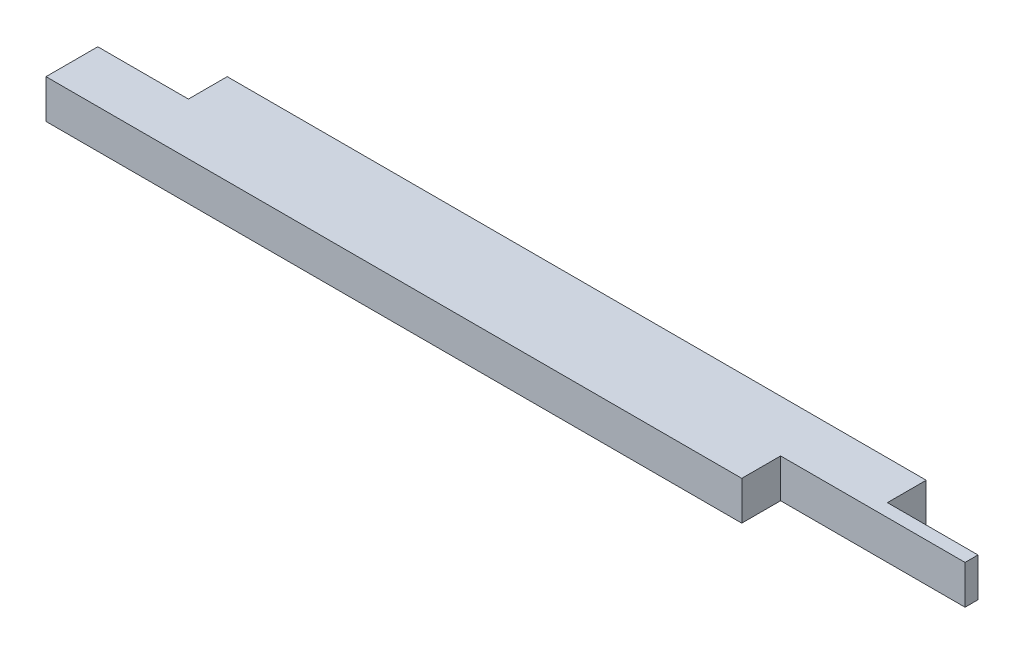
ISO-10303-21;
HEADER;
FILE_DESCRIPTION(('STEP AP214'),'2;1');
FILE_NAME('part.step','',(''),(''),'','','');
FILE_SCHEMA(('AUTOMOTIVE_DESIGN { 1 0 10303 214 1 1 1 1 }'));
ENDSEC;
DATA;
#1=APPLICATION_CONTEXT('core data for automotive mechanical design processes');
#2=APPLICATION_PROTOCOL_DEFINITION('international standard','automotive_design',2000,#1);
#3=PRODUCT_CONTEXT('',#1,'mechanical');
#4=PRODUCT('Part','Part','',(#3));
#5=PRODUCT_RELATED_PRODUCT_CATEGORY('part','',(#4));
#6=PRODUCT_DEFINITION_FORMATION('','',#4);
#7=PRODUCT_DEFINITION_CONTEXT('part definition',#1,'design');
#8=PRODUCT_DEFINITION('design','',#6,#7);
#9=PRODUCT_DEFINITION_SHAPE('','',#8);
#10=(LENGTH_UNIT() NAMED_UNIT(*) SI_UNIT(.MILLI.,.METRE.));
#11=(NAMED_UNIT(*) PLANE_ANGLE_UNIT() SI_UNIT($,.RADIAN.));
#12=(NAMED_UNIT(*) SI_UNIT($,.STERADIAN.) SOLID_ANGLE_UNIT());
#13=UNCERTAINTY_MEASURE_WITH_UNIT(LENGTH_MEASURE(1.E-05),#10,'distance_accuracy_value','');
#14=(GEOMETRIC_REPRESENTATION_CONTEXT(3) GLOBAL_UNCERTAINTY_ASSIGNED_CONTEXT((#13)) GLOBAL_UNIT_ASSIGNED_CONTEXT((#10,
#11,#12)) REPRESENTATION_CONTEXT('',''));
#15=CARTESIAN_POINT('',(0.,0.,0.));
#16=DIRECTION('',(0.,0.,1.));
#17=DIRECTION('',(1.,0.,0.));
#18=AXIS2_PLACEMENT_3D('',#15,#16,#17);
#19=CARTESIAN_POINT('',(0.,38.1,0.));
#20=DIRECTION('',(1.,0.,0.));
#21=DIRECTION('',(0.,0.,-1.));
#22=AXIS2_PLACEMENT_3D('',#19,#20,#21);
#23=PLANE('',#22);
#24=DIRECTION('',(0.,0.,1.));
#25=VECTOR('',#24,1.);
#26=CARTESIAN_POINT('',(0.,38.1,0.));
#27=LINE('',#26,#25);
#28=CARTESIAN_POINT('',(0.,38.1,-50.8));
#29=VERTEX_POINT('',#28);
#30=CARTESIAN_POINT('',(0.,38.1,0.));
#31=VERTEX_POINT('',#30);
#32=EDGE_CURVE('E141',#29,#31,#27,.T.);
#33=ORIENTED_EDGE('',*,*,#32,.F.);
#34=DIRECTION('',(0.,1.,0.));
#35=VECTOR('',#34,1.);
#36=CARTESIAN_POINT('',(0.,0.,-50.8));
#37=LINE('',#36,#35);
#38=CARTESIAN_POINT('',(0.,0.,-50.8));
#39=VERTEX_POINT('',#38);
#40=EDGE_CURVE('E172',#39,#29,#37,.T.);
#41=ORIENTED_EDGE('',*,*,#40,.F.);
#42=DIRECTION('',(0.,0.,1.));
#43=VECTOR('',#42,1.);
#44=CARTESIAN_POINT('',(0.,0.,0.));
#45=LINE('',#44,#43);
#46=CARTESIAN_POINT('',(0.,0.,0.));
#47=VERTEX_POINT('',#46);
#48=EDGE_CURVE('E143',#39,#47,#45,.T.);
#49=ORIENTED_EDGE('',*,*,#48,.T.);
#50=DIRECTION('',(0.,-1.,0.));
#51=VECTOR('',#50,1.);
#52=CARTESIAN_POINT('',(0.,38.1,0.));
#53=LINE('',#52,#51);
#54=EDGE_CURVE('E11',#31,#47,#53,.T.);
#55=ORIENTED_EDGE('',*,*,#54,.F.);
#56=EDGE_LOOP('',(#33,#41,#49,#55));
#57=FACE_BOUND('',#56,.T.);
#58=ADVANCED_FACE('F39',(#57),#23,.F.);
#59=CARTESIAN_POINT('',(0.,38.1,0.));
#60=DIRECTION('',(0.,0.,-1.));
#61=DIRECTION('',(-1.,0.,0.));
#62=AXIS2_PLACEMENT_3D('',#59,#60,#61);
#63=PLANE('',#62);
#64=DIRECTION('',(1.,0.,0.));
#65=VECTOR('',#64,1.);
#66=CARTESIAN_POINT('',(0.,0.,0.));
#67=LINE('',#66,#65);
#68=CARTESIAN_POINT('',(682.625,0.,0.));
#69=VERTEX_POINT('',#68);
#70=EDGE_CURVE('E138',#47,#69,#67,.T.);
#71=ORIENTED_EDGE('',*,*,#70,.T.);
#72=DIRECTION('',(0.,1.,0.));
#73=VECTOR('',#72,1.);
#74=CARTESIAN_POINT('',(682.625,0.,0.));
#75=LINE('',#74,#73);
#76=CARTESIAN_POINT('',(682.625,38.1,0.));
#77=VERTEX_POINT('',#76);
#78=EDGE_CURVE('E169',#69,#77,#75,.T.);
#79=ORIENTED_EDGE('',*,*,#78,.T.);
#80=DIRECTION('',(1.,0.,0.));
#81=VECTOR('',#80,1.);
#82=CARTESIAN_POINT('',(0.,38.1,0.));
#83=LINE('',#82,#81);
#84=EDGE_CURVE('E151',#31,#77,#83,.T.);
#85=ORIENTED_EDGE('',*,*,#84,.F.);
#86=ORIENTED_EDGE('',*,*,#54,.T.);
#87=EDGE_LOOP('',(#71,#79,#85,#86));
#88=FACE_BOUND('',#87,.T.);
#89=ADVANCED_FACE('F195',(#88),#63,.F.);
#90=CARTESIAN_POINT('',(863.6,38.1,0.));
#91=DIRECTION('',(-1.,0.,0.));
#92=DIRECTION('',(0.,0.,1.));
#93=AXIS2_PLACEMENT_3D('',#90,#91,#92);
#94=PLANE('',#93);
#95=DIRECTION('',(0.,0.,-1.));
#96=VECTOR('',#95,1.);
#97=CARTESIAN_POINT('',(863.6,38.1,0.));
#98=LINE('',#97,#96);
#99=CARTESIAN_POINT('',(863.6,38.1,-38.1));
#100=VERTEX_POINT('',#99);
#101=CARTESIAN_POINT('',(863.6,38.1,-50.8));
#102=VERTEX_POINT('',#101);
#103=EDGE_CURVE('E131',#100,#102,#98,.T.);
#104=ORIENTED_EDGE('',*,*,#103,.F.);
#105=DIRECTION('',(0.,1.,0.));
#106=VECTOR('',#105,1.);
#107=CARTESIAN_POINT('',(863.6,0.,-38.1));
#108=LINE('',#107,#106);
#109=CARTESIAN_POINT('',(863.6,0.,-38.1));
#110=VERTEX_POINT('',#109);
#111=EDGE_CURVE('E118',#110,#100,#108,.T.);
#112=ORIENTED_EDGE('',*,*,#111,.F.);
#113=DIRECTION('',(0.,0.,-1.));
#114=VECTOR('',#113,1.);
#115=CARTESIAN_POINT('',(863.6,0.,0.));
#116=LINE('',#115,#114);
#117=CARTESIAN_POINT('',(863.6,0.,-50.8));
#118=VERTEX_POINT('',#117);
#119=EDGE_CURVE('E129',#110,#118,#116,.T.);
#120=ORIENTED_EDGE('',*,*,#119,.T.);
#121=DIRECTION('',(0.,1.,0.));
#122=VECTOR('',#121,1.);
#123=CARTESIAN_POINT('',(863.6,0.,-50.8));
#124=LINE('',#123,#122);
#125=EDGE_CURVE('E166',#118,#102,#124,.T.);
#126=ORIENTED_EDGE('',*,*,#125,.T.);
#127=EDGE_LOOP('',(#104,#112,#120,#126));
#128=FACE_BOUND('',#127,.T.);
#129=ADVANCED_FACE('F127',(#128),#94,.F.);
#130=CARTESIAN_POINT('',(0.,38.1,-88.9));
#131=DIRECTION('',(0.,0.,1.));
#132=DIRECTION('',(1.,0.,0.));
#133=AXIS2_PLACEMENT_3D('',#130,#131,#132);
#134=PLANE('',#133);
#135=DIRECTION('',(-1.,0.,0.));
#136=VECTOR('',#135,1.);
#137=CARTESIAN_POINT('',(0.,0.,-88.9));
#138=LINE('',#137,#136);
#139=CARTESIAN_POINT('',(774.7,0.,-88.9));
#140=VERTEX_POINT('',#139);
#141=CARTESIAN_POINT('',(88.9,0.,-88.9));
#142=VERTEX_POINT('',#141);
#143=EDGE_CURVE('E137',#140,#142,#138,.T.);
#144=ORIENTED_EDGE('',*,*,#143,.T.);
#145=DIRECTION('',(0.,1.,0.));
#146=VECTOR('',#145,1.);
#147=CARTESIAN_POINT('',(88.9,0.,-88.9));
#148=LINE('',#147,#146);
#149=CARTESIAN_POINT('',(88.9,38.1,-88.9));
#150=VERTEX_POINT('',#149);
#151=EDGE_CURVE('E147',#142,#150,#148,.T.);
#152=ORIENTED_EDGE('',*,*,#151,.T.);
#153=DIRECTION('',(-1.,0.,0.));
#154=VECTOR('',#153,1.);
#155=CARTESIAN_POINT('',(0.,38.1,-88.9));
#156=LINE('',#155,#154);
#157=CARTESIAN_POINT('',(774.7,38.1,-88.9));
#158=VERTEX_POINT('',#157);
#159=EDGE_CURVE('E46',#158,#150,#156,.T.);
#160=ORIENTED_EDGE('',*,*,#159,.F.);
#161=DIRECTION('',(0.,1.,0.));
#162=VECTOR('',#161,1.);
#163=CARTESIAN_POINT('',(774.7,0.,-88.9));
#164=LINE('',#163,#162);
#165=EDGE_CURVE('E159',#140,#158,#164,.T.);
#166=ORIENTED_EDGE('',*,*,#165,.F.);
#167=EDGE_LOOP('',(#144,#152,#160,#166));
#168=FACE_BOUND('',#167,.T.);
#169=ADVANCED_FACE('F210',(#168),#134,.F.);
#170=CARTESIAN_POINT('',(0.,38.1,0.));
#171=DIRECTION('',(0.,-1.,0.));
#172=DIRECTION('',(0.,0.,-1.));
#173=AXIS2_PLACEMENT_3D('',#170,#171,#172);
#174=PLANE('',#173);
#175=ORIENTED_EDGE('',*,*,#84,.T.);
#176=DIRECTION('',(0.,0.,1.));
#177=VECTOR('',#176,1.);
#178=CARTESIAN_POINT('',(682.625,38.1,0.));
#179=LINE('',#178,#177);
#180=CARTESIAN_POINT('',(682.625,38.1,-38.1));
#181=VERTEX_POINT('',#180);
#182=EDGE_CURVE('E123',#181,#77,#179,.T.);
#183=ORIENTED_EDGE('',*,*,#182,.F.);
#184=DIRECTION('',(-1.,0.,0.));
#185=VECTOR('',#184,1.);
#186=CARTESIAN_POINT('',(863.6,38.1,-38.1));
#187=LINE('',#186,#185);
#188=EDGE_CURVE('E190',#100,#181,#187,.T.);
#189=ORIENTED_EDGE('',*,*,#188,.F.);
#190=ORIENTED_EDGE('',*,*,#103,.T.);
#191=DIRECTION('',(1.,0.,0.));
#192=VECTOR('',#191,1.);
#193=CARTESIAN_POINT('',(863.6,38.1,-50.8));
#194=LINE('',#193,#192);
#195=CARTESIAN_POINT('',(774.7,38.1,-50.8));
#196=VERTEX_POINT('',#195);
#197=EDGE_CURVE('E157',#196,#102,#194,.T.);
#198=ORIENTED_EDGE('',*,*,#197,.F.);
#199=DIRECTION('',(0.,0.,1.));
#200=VECTOR('',#199,1.);
#201=CARTESIAN_POINT('',(774.7,38.1,-88.9));
#202=LINE('',#201,#200);
#203=EDGE_CURVE('E160',#158,#196,#202,.T.);
#204=ORIENTED_EDGE('',*,*,#203,.F.);
#205=ORIENTED_EDGE('',*,*,#159,.T.);
#206=DIRECTION('',(0.,0.,-1.));
#207=VECTOR('',#206,1.);
#208=CARTESIAN_POINT('',(88.9,38.1,-88.9));
#209=LINE('',#208,#207);
#210=CARTESIAN_POINT('',(88.9,38.1,-50.8));
#211=VERTEX_POINT('',#210);
#212=EDGE_CURVE('E178',#211,#150,#209,.T.);
#213=ORIENTED_EDGE('',*,*,#212,.F.);
#214=DIRECTION('',(1.,0.,0.));
#215=VECTOR('',#214,1.);
#216=CARTESIAN_POINT('',(0.,38.1,-50.8));
#217=LINE('',#216,#215);
#218=EDGE_CURVE('E163',#29,#211,#217,.T.);
#219=ORIENTED_EDGE('',*,*,#218,.F.);
#220=ORIENTED_EDGE('',*,*,#32,.T.);
#221=EDGE_LOOP('',(#175,#183,#189,#190,#198,#204,#205,#213,#219,#220));
#222=FACE_BOUND('',#221,.T.);
#223=ADVANCED_FACE('F213',(#222),#174,.F.);
#224=CARTESIAN_POINT('',(0.,0.,0.));
#225=DIRECTION('',(0.,-1.,0.));
#226=DIRECTION('',(0.,0.,-1.));
#227=AXIS2_PLACEMENT_3D('',#224,#225,#226);
#228=PLANE('',#227);
#229=DIRECTION('',(0.,0.,1.));
#230=VECTOR('',#229,1.);
#231=CARTESIAN_POINT('',(682.625,0.,0.));
#232=LINE('',#231,#230);
#233=CARTESIAN_POINT('',(682.625,0.,-38.1));
#234=VERTEX_POINT('',#233);
#235=EDGE_CURVE('E53',#234,#69,#232,.T.);
#236=ORIENTED_EDGE('',*,*,#235,.T.);
#237=ORIENTED_EDGE('',*,*,#70,.F.);
#238=ORIENTED_EDGE('',*,*,#48,.F.);
#239=DIRECTION('',(1.,0.,0.));
#240=VECTOR('',#239,1.);
#241=CARTESIAN_POINT('',(0.,0.,-50.8));
#242=LINE('',#241,#240);
#243=CARTESIAN_POINT('',(88.9,0.,-50.8));
#244=VERTEX_POINT('',#243);
#245=EDGE_CURVE('E180',#39,#244,#242,.T.);
#246=ORIENTED_EDGE('',*,*,#245,.T.);
#247=DIRECTION('',(0.,0.,-1.));
#248=VECTOR('',#247,1.);
#249=CARTESIAN_POINT('',(88.9,0.,-88.9));
#250=LINE('',#249,#248);
#251=EDGE_CURVE('E61',#244,#142,#250,.T.);
#252=ORIENTED_EDGE('',*,*,#251,.T.);
#253=ORIENTED_EDGE('',*,*,#143,.F.);
#254=DIRECTION('',(0.,0.,1.));
#255=VECTOR('',#254,1.);
#256=CARTESIAN_POINT('',(774.7,0.,-88.9));
#257=LINE('',#256,#255);
#258=CARTESIAN_POINT('',(774.7,0.,-50.8));
#259=VERTEX_POINT('',#258);
#260=EDGE_CURVE('E155',#140,#259,#257,.T.);
#261=ORIENTED_EDGE('',*,*,#260,.T.);
#262=DIRECTION('',(1.,0.,0.));
#263=VECTOR('',#262,1.);
#264=CARTESIAN_POINT('',(863.6,0.,-50.8));
#265=LINE('',#264,#263);
#266=EDGE_CURVE('E136',#259,#118,#265,.T.);
#267=ORIENTED_EDGE('',*,*,#266,.T.);
#268=ORIENTED_EDGE('',*,*,#119,.F.);
#269=DIRECTION('',(-1.,0.,0.));
#270=VECTOR('',#269,1.);
#271=CARTESIAN_POINT('',(863.6,0.,-38.1));
#272=LINE('',#271,#270);
#273=EDGE_CURVE('E114',#110,#234,#272,.T.);
#274=ORIENTED_EDGE('',*,*,#273,.T.);
#275=EDGE_LOOP('',(#236,#237,#238,#246,#252,#253,#261,#267,#268,#274));
#276=FACE_BOUND('',#275,.T.);
#277=ADVANCED_FACE('F134',(#276),#228,.T.);
#278=CARTESIAN_POINT('',(863.6,0.,-50.8));
#279=DIRECTION('',(0.,0.,1.));
#280=DIRECTION('',(1.,0.,0.));
#281=AXIS2_PLACEMENT_3D('',#278,#279,#280);
#282=PLANE('',#281);
#283=ORIENTED_EDGE('',*,*,#197,.T.);
#284=ORIENTED_EDGE('',*,*,#125,.F.);
#285=ORIENTED_EDGE('',*,*,#266,.F.);
#286=DIRECTION('',(0.,1.,0.));
#287=VECTOR('',#286,1.);
#288=CARTESIAN_POINT('',(774.7,0.,-50.8));
#289=LINE('',#288,#287);
#290=EDGE_CURVE('E168',#259,#196,#289,.T.);
#291=ORIENTED_EDGE('',*,*,#290,.T.);
#292=EDGE_LOOP('',(#283,#284,#285,#291));
#293=FACE_BOUND('',#292,.T.);
#294=ADVANCED_FACE('F219',(#293),#282,.F.);
#295=CARTESIAN_POINT('',(774.7,0.,-88.9));
#296=DIRECTION('',(-1.,0.,0.));
#297=DIRECTION('',(0.,0.,1.));
#298=AXIS2_PLACEMENT_3D('',#295,#296,#297);
#299=PLANE('',#298);
#300=ORIENTED_EDGE('',*,*,#203,.T.);
#301=ORIENTED_EDGE('',*,*,#290,.F.);
#302=ORIENTED_EDGE('',*,*,#260,.F.);
#303=ORIENTED_EDGE('',*,*,#165,.T.);
#304=EDGE_LOOP('',(#300,#301,#302,#303));
#305=FACE_BOUND('',#304,.T.);
#306=ADVANCED_FACE('F217',(#305),#299,.F.);
#307=CARTESIAN_POINT('',(88.9,0.,-88.9));
#308=DIRECTION('',(1.,0.,0.));
#309=DIRECTION('',(0.,0.,-1.));
#310=AXIS2_PLACEMENT_3D('',#307,#308,#309);
#311=PLANE('',#310);
#312=ORIENTED_EDGE('',*,*,#212,.T.);
#313=ORIENTED_EDGE('',*,*,#151,.F.);
#314=ORIENTED_EDGE('',*,*,#251,.F.);
#315=DIRECTION('',(0.,1.,0.));
#316=VECTOR('',#315,1.);
#317=CARTESIAN_POINT('',(88.9,0.,-50.8));
#318=LINE('',#317,#316);
#319=EDGE_CURVE('E174',#244,#211,#318,.T.);
#320=ORIENTED_EDGE('',*,*,#319,.T.);
#321=EDGE_LOOP('',(#312,#313,#314,#320));
#322=FACE_BOUND('',#321,.T.);
#323=ADVANCED_FACE('F206',(#322),#311,.F.);
#324=CARTESIAN_POINT('',(0.,0.,-50.8));
#325=DIRECTION('',(0.,0.,1.));
#326=DIRECTION('',(1.,0.,0.));
#327=AXIS2_PLACEMENT_3D('',#324,#325,#326);
#328=PLANE('',#327);
#329=ORIENTED_EDGE('',*,*,#218,.T.);
#330=ORIENTED_EDGE('',*,*,#319,.F.);
#331=ORIENTED_EDGE('',*,*,#245,.F.);
#332=ORIENTED_EDGE('',*,*,#40,.T.);
#333=EDGE_LOOP('',(#329,#330,#331,#332));
#334=FACE_BOUND('',#333,.T.);
#335=ADVANCED_FACE('F203',(#334),#328,.F.);
#336=CARTESIAN_POINT('',(682.625,0.,0.));
#337=DIRECTION('',(-1.,0.,0.));
#338=DIRECTION('',(0.,0.,1.));
#339=AXIS2_PLACEMENT_3D('',#336,#337,#338);
#340=PLANE('',#339);
#341=ORIENTED_EDGE('',*,*,#182,.T.);
#342=ORIENTED_EDGE('',*,*,#78,.F.);
#343=ORIENTED_EDGE('',*,*,#235,.F.);
#344=DIRECTION('',(0.,1.,0.));
#345=VECTOR('',#344,1.);
#346=CARTESIAN_POINT('',(682.625,0.,-38.1));
#347=LINE('',#346,#345);
#348=EDGE_CURVE('E120',#234,#181,#347,.T.);
#349=ORIENTED_EDGE('',*,*,#348,.T.);
#350=EDGE_LOOP('',(#341,#342,#343,#349));
#351=FACE_BOUND('',#350,.T.);
#352=ADVANCED_FACE('F255',(#351),#340,.F.);
#353=CARTESIAN_POINT('',(863.6,0.,-38.1));
#354=DIRECTION('',(0.,0.,-1.));
#355=DIRECTION('',(-1.,0.,0.));
#356=AXIS2_PLACEMENT_3D('',#353,#354,#355);
#357=PLANE('',#356);
#358=ORIENTED_EDGE('',*,*,#188,.T.);
#359=ORIENTED_EDGE('',*,*,#348,.F.);
#360=ORIENTED_EDGE('',*,*,#273,.F.);
#361=ORIENTED_EDGE('',*,*,#111,.T.);
#362=EDGE_LOOP('',(#358,#359,#360,#361));
#363=FACE_BOUND('',#362,.T.);
#364=ADVANCED_FACE('F117',(#363),#357,.F.);
#365=CLOSED_SHELL('',(#58,#89,#129,#169,#223,#277,#294,#306,#323,#335,#352,#364));
#366=MANIFOLD_SOLID_BREP('B2',#365);
#367=ADVANCED_BREP_SHAPE_REPRESENTATION('',(#18,#366),#14);
#368=SHAPE_DEFINITION_REPRESENTATION(#9,#367);
ENDSEC;
END-ISO-10303-21;
